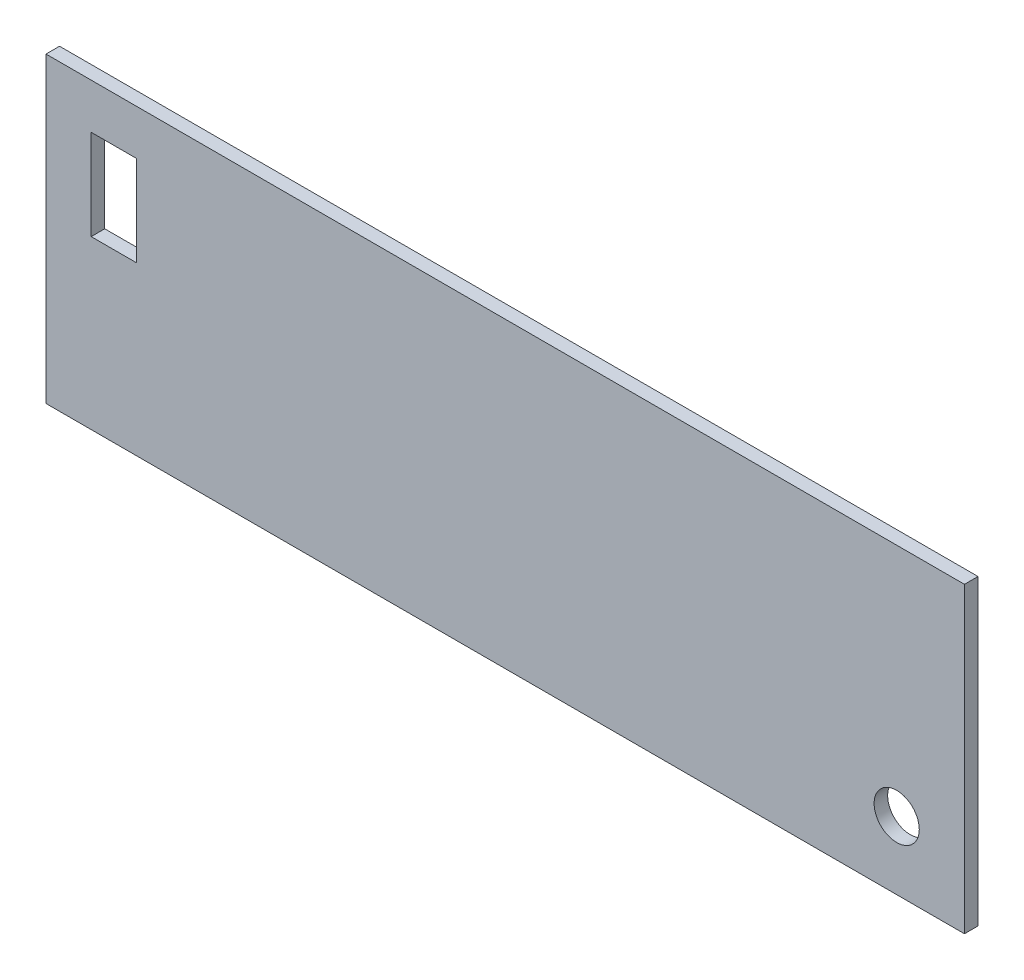
ISO-10303-21;
HEADER;
FILE_DESCRIPTION(('STEP AP214'),'2;1');
FILE_NAME('part.step','',(''),(''),'','','');
FILE_SCHEMA(('AUTOMOTIVE_DESIGN { 1 0 10303 214 1 1 1 1 }'));
ENDSEC;
DATA;
#1=APPLICATION_CONTEXT('core data for automotive mechanical design processes');
#2=APPLICATION_PROTOCOL_DEFINITION('international standard','automotive_design',2000,#1);
#3=PRODUCT_CONTEXT('',#1,'mechanical');
#4=PRODUCT('Part','Part','',(#3));
#5=PRODUCT_RELATED_PRODUCT_CATEGORY('part','',(#4));
#6=PRODUCT_DEFINITION_FORMATION('','',#4);
#7=PRODUCT_DEFINITION_CONTEXT('part definition',#1,'design');
#8=PRODUCT_DEFINITION('design','',#6,#7);
#9=PRODUCT_DEFINITION_SHAPE('','',#8);
#10=(LENGTH_UNIT() NAMED_UNIT(*) SI_UNIT(.MILLI.,.METRE.));
#11=(NAMED_UNIT(*) PLANE_ANGLE_UNIT() SI_UNIT($,.RADIAN.));
#12=(NAMED_UNIT(*) SI_UNIT($,.STERADIAN.) SOLID_ANGLE_UNIT());
#13=UNCERTAINTY_MEASURE_WITH_UNIT(LENGTH_MEASURE(1.E-05),#10,'distance_accuracy_value','');
#14=(GEOMETRIC_REPRESENTATION_CONTEXT(3) GLOBAL_UNCERTAINTY_ASSIGNED_CONTEXT((#13)) GLOBAL_UNIT_ASSIGNED_CONTEXT((#10,
#11,#12)) REPRESENTATION_CONTEXT('',''));
#15=CARTESIAN_POINT('',(0.,0.,0.));
#16=DIRECTION('',(0.,0.,1.));
#17=DIRECTION('',(1.,0.,0.));
#18=AXIS2_PLACEMENT_3D('',#15,#16,#17);
#19=CARTESIAN_POINT('',(101.655,-33.5,-3.));
#20=DIRECTION('',(1.,0.,0.));
#21=DIRECTION('',(0.,0.,-1.));
#22=AXIS2_PLACEMENT_3D('',#19,#20,#21);
#23=PLANE('',#22);
#24=DIRECTION('',(0.,1.,0.));
#25=VECTOR('',#24,1.);
#26=CARTESIAN_POINT('',(101.655,-33.5,0.));
#27=LINE('',#26,#25);
#28=CARTESIAN_POINT('',(101.655,-33.5,0.));
#29=VERTEX_POINT('',#28);
#30=CARTESIAN_POINT('',(101.655,33.5,0.));
#31=VERTEX_POINT('',#30);
#32=EDGE_CURVE('E116',#29,#31,#27,.T.);
#33=ORIENTED_EDGE('',*,*,#32,.F.);
#34=DIRECTION('',(0.,0.,1.));
#35=VECTOR('',#34,1.);
#36=CARTESIAN_POINT('',(101.655,-33.5,-3.));
#37=LINE('',#36,#35);
#38=CARTESIAN_POINT('',(101.655,-33.5,-3.));
#39=VERTEX_POINT('',#38);
#40=EDGE_CURVE('E11',#39,#29,#37,.T.);
#41=ORIENTED_EDGE('',*,*,#40,.F.);
#42=DIRECTION('',(0.,1.,0.));
#43=VECTOR('',#42,1.);
#44=CARTESIAN_POINT('',(101.655,-33.5,-3.));
#45=LINE('',#44,#43);
#46=CARTESIAN_POINT('',(101.655,33.5,-3.));
#47=VERTEX_POINT('',#46);
#48=EDGE_CURVE('E157',#39,#47,#45,.T.);
#49=ORIENTED_EDGE('',*,*,#48,.T.);
#50=DIRECTION('',(0.,0.,1.));
#51=VECTOR('',#50,1.);
#52=CARTESIAN_POINT('',(101.655,33.5,-3.));
#53=LINE('',#52,#51);
#54=EDGE_CURVE('E46',#47,#31,#53,.T.);
#55=ORIENTED_EDGE('',*,*,#54,.T.);
#56=EDGE_LOOP('',(#33,#41,#49,#55));
#57=FACE_BOUND('',#56,.T.);
#58=ADVANCED_FACE('F43',(#57),#23,.T.);
#59=CARTESIAN_POINT('',(-101.655,-33.5,-3.));
#60=DIRECTION('',(0.,-1.,0.));
#61=DIRECTION('',(0.,0.,-1.));
#62=AXIS2_PLACEMENT_3D('',#59,#60,#61);
#63=PLANE('',#62);
#64=DIRECTION('',(1.,0.,0.));
#65=VECTOR('',#64,1.);
#66=CARTESIAN_POINT('',(-101.655,-33.5,0.));
#67=LINE('',#66,#65);
#68=CARTESIAN_POINT('',(-101.655,-33.5,0.));
#69=VERTEX_POINT('',#68);
#70=EDGE_CURVE('E162',#69,#29,#67,.T.);
#71=ORIENTED_EDGE('',*,*,#70,.F.);
#72=DIRECTION('',(0.,0.,1.));
#73=VECTOR('',#72,1.);
#74=CARTESIAN_POINT('',(-101.655,-33.5,-3.));
#75=LINE('',#74,#73);
#76=CARTESIAN_POINT('',(-101.655,-33.5,-3.));
#77=VERTEX_POINT('',#76);
#78=EDGE_CURVE('E52',#77,#69,#75,.T.);
#79=ORIENTED_EDGE('',*,*,#78,.F.);
#80=DIRECTION('',(1.,0.,0.));
#81=VECTOR('',#80,1.);
#82=CARTESIAN_POINT('',(-101.655,-33.5,-3.));
#83=LINE('',#82,#81);
#84=EDGE_CURVE('E170',#77,#39,#83,.T.);
#85=ORIENTED_EDGE('',*,*,#84,.T.);
#86=ORIENTED_EDGE('',*,*,#40,.T.);
#87=EDGE_LOOP('',(#71,#79,#85,#86));
#88=FACE_BOUND('',#87,.T.);
#89=ADVANCED_FACE('F208',(#88),#63,.T.);
#90=CARTESIAN_POINT('',(-101.655,-33.5,-3.));
#91=DIRECTION('',(-1.,0.,0.));
#92=DIRECTION('',(0.,0.,1.));
#93=AXIS2_PLACEMENT_3D('',#90,#91,#92);
#94=PLANE('',#93);
#95=DIRECTION('',(0.,-1.,0.));
#96=VECTOR('',#95,1.);
#97=CARTESIAN_POINT('',(-101.655,-33.5,0.));
#98=LINE('',#97,#96);
#99=CARTESIAN_POINT('',(-101.655,33.5,0.));
#100=VERTEX_POINT('',#99);
#101=EDGE_CURVE('E181',#100,#69,#98,.T.);
#102=ORIENTED_EDGE('',*,*,#101,.F.);
#103=DIRECTION('',(0.,0.,1.));
#104=VECTOR('',#103,1.);
#105=CARTESIAN_POINT('',(-101.655,33.5,-3.));
#106=LINE('',#105,#104);
#107=CARTESIAN_POINT('',(-101.655,33.5,-3.));
#108=VERTEX_POINT('',#107);
#109=EDGE_CURVE('E189',#108,#100,#106,.T.);
#110=ORIENTED_EDGE('',*,*,#109,.F.);
#111=DIRECTION('',(0.,-1.,0.));
#112=VECTOR('',#111,1.);
#113=CARTESIAN_POINT('',(-101.655,-33.5,-3.));
#114=LINE('',#113,#112);
#115=EDGE_CURVE('E166',#108,#77,#114,.T.);
#116=ORIENTED_EDGE('',*,*,#115,.T.);
#117=ORIENTED_EDGE('',*,*,#78,.T.);
#118=EDGE_LOOP('',(#102,#110,#116,#117));
#119=FACE_BOUND('',#118,.T.);
#120=ADVANCED_FACE('F212',(#119),#94,.T.);
#121=CARTESIAN_POINT('',(-101.655,33.5,-3.));
#122=DIRECTION('',(0.,1.,0.));
#123=DIRECTION('',(0.,0.,1.));
#124=AXIS2_PLACEMENT_3D('',#121,#122,#123);
#125=PLANE('',#124);
#126=DIRECTION('',(-1.,0.,0.));
#127=VECTOR('',#126,1.);
#128=CARTESIAN_POINT('',(-101.655,33.5,0.));
#129=LINE('',#128,#127);
#130=EDGE_CURVE('E177',#31,#100,#129,.T.);
#131=ORIENTED_EDGE('',*,*,#130,.F.);
#132=ORIENTED_EDGE('',*,*,#54,.F.);
#133=DIRECTION('',(-1.,0.,0.));
#134=VECTOR('',#133,1.);
#135=CARTESIAN_POINT('',(-101.655,33.5,-3.));
#136=LINE('',#135,#134);
#137=EDGE_CURVE('E161',#47,#108,#136,.T.);
#138=ORIENTED_EDGE('',*,*,#137,.T.);
#139=ORIENTED_EDGE('',*,*,#109,.T.);
#140=EDGE_LOOP('',(#131,#132,#138,#139));
#141=FACE_BOUND('',#140,.T.);
#142=ADVANCED_FACE('F203',(#141),#125,.T.);
#143=CARTESIAN_POINT('',(0.,0.,-3.));
#144=DIRECTION('',(0.,0.,-1.));
#145=DIRECTION('',(-1.,0.,0.));
#146=AXIS2_PLACEMENT_3D('',#143,#144,#145);
#147=PLANE('',#146);
#148=CARTESIAN_POINT('',(86.655,-18.5,-3.));
#149=DIRECTION('',(0.,0.,-1.));
#150=DIRECTION('',(-1.,0.,0.));
#151=AXIS2_PLACEMENT_3D('',#148,#149,#150);
#152=CIRCLE('',#151,5.);
#153=CARTESIAN_POINT('',(81.6549999999999,-18.5,-3.));
#154=VERTEX_POINT('',#153);
#155=EDGE_CURVE('E332',#154,#154,#152,.F.);
#156=ORIENTED_EDGE('',*,*,#155,.T.);
#157=EDGE_LOOP('',(#156));
#158=FACE_BOUND('',#157,.T.);
#159=DIRECTION('',(0.,1.,0.));
#160=VECTOR('',#159,1.);
#161=CARTESIAN_POINT('',(-81.655,3.5,-3.));
#162=LINE('',#161,#160);
#163=CARTESIAN_POINT('',(-81.655,3.5,-3.));
#164=VERTEX_POINT('',#163);
#165=CARTESIAN_POINT('',(-81.655,23.5,-3.));
#166=VERTEX_POINT('',#165);
#167=EDGE_CURVE('E120',#164,#166,#162,.T.);
#168=ORIENTED_EDGE('',*,*,#167,.T.);
#169=DIRECTION('',(-1.,0.,0.));
#170=VECTOR('',#169,1.);
#171=CARTESIAN_POINT('',(-91.655,23.5,-3.));
#172=LINE('',#171,#170);
#173=CARTESIAN_POINT('',(-91.655,23.5,-3.));
#174=VERTEX_POINT('',#173);
#175=EDGE_CURVE('E108',#166,#174,#172,.T.);
#176=ORIENTED_EDGE('',*,*,#175,.T.);
#177=DIRECTION('',(0.,-1.,0.));
#178=VECTOR('',#177,1.);
#179=CARTESIAN_POINT('',(-91.655,3.5,-3.));
#180=LINE('',#179,#178);
#181=CARTESIAN_POINT('',(-91.655,3.5,-3.));
#182=VERTEX_POINT('',#181);
#183=EDGE_CURVE('E137',#174,#182,#180,.T.);
#184=ORIENTED_EDGE('',*,*,#183,.T.);
#185=DIRECTION('',(1.,0.,0.));
#186=VECTOR('',#185,1.);
#187=CARTESIAN_POINT('',(-91.655,3.5,-3.));
#188=LINE('',#187,#186);
#189=EDGE_CURVE('E128',#182,#164,#188,.T.);
#190=ORIENTED_EDGE('',*,*,#189,.T.);
#191=EDGE_LOOP('',(#168,#176,#184,#190));
#192=FACE_BOUND('',#191,.T.);
#193=ORIENTED_EDGE('',*,*,#48,.F.);
#194=ORIENTED_EDGE('',*,*,#84,.F.);
#195=ORIENTED_EDGE('',*,*,#115,.F.);
#196=ORIENTED_EDGE('',*,*,#137,.F.);
#197=EDGE_LOOP('',(#193,#194,#195,#196));
#198=FACE_BOUND('',#197,.T.);
#199=ADVANCED_FACE('F126',(#158,#192,#198),#147,.T.);
#200=CARTESIAN_POINT('',(0.,0.,0.));
#201=DIRECTION('',(0.,0.,-1.));
#202=DIRECTION('',(-1.,0.,0.));
#203=AXIS2_PLACEMENT_3D('',#200,#201,#202);
#204=PLANE('',#203);
#205=CARTESIAN_POINT('',(86.655,-18.5,0.));
#206=DIRECTION('',(0.,0.,1.));
#207=DIRECTION('',(1.,0.,0.));
#208=AXIS2_PLACEMENT_3D('',#205,#206,#207);
#209=CIRCLE('',#208,5.);
#210=CARTESIAN_POINT('',(91.655,-18.5,0.));
#211=VERTEX_POINT('',#210);
#212=EDGE_CURVE('E335',#211,#211,#209,.T.);
#213=ORIENTED_EDGE('',*,*,#212,.F.);
#214=EDGE_LOOP('',(#213));
#215=FACE_BOUND('',#214,.T.);
#216=DIRECTION('',(-1.,0.,0.));
#217=VECTOR('',#216,1.);
#218=CARTESIAN_POINT('',(-91.655,23.5,0.));
#219=LINE('',#218,#217);
#220=CARTESIAN_POINT('',(-81.655,23.5,0.));
#221=VERTEX_POINT('',#220);
#222=CARTESIAN_POINT('',(-91.655,23.5,0.));
#223=VERTEX_POINT('',#222);
#224=EDGE_CURVE('E135',#221,#223,#219,.T.);
#225=ORIENTED_EDGE('',*,*,#224,.F.);
#226=DIRECTION('',(0.,1.,0.));
#227=VECTOR('',#226,1.);
#228=CARTESIAN_POINT('',(-81.655,3.5,0.));
#229=LINE('',#228,#227);
#230=CARTESIAN_POINT('',(-81.655,3.5,0.));
#231=VERTEX_POINT('',#230);
#232=EDGE_CURVE('E68',#231,#221,#229,.T.);
#233=ORIENTED_EDGE('',*,*,#232,.F.);
#234=DIRECTION('',(1.,0.,0.));
#235=VECTOR('',#234,1.);
#236=CARTESIAN_POINT('',(-91.655,3.5,0.));
#237=LINE('',#236,#235);
#238=CARTESIAN_POINT('',(-91.655,3.5,0.));
#239=VERTEX_POINT('',#238);
#240=EDGE_CURVE('E123',#239,#231,#237,.T.);
#241=ORIENTED_EDGE('',*,*,#240,.F.);
#242=DIRECTION('',(0.,-1.,0.));
#243=VECTOR('',#242,1.);
#244=CARTESIAN_POINT('',(-91.655,3.5,0.));
#245=LINE('',#244,#243);
#246=EDGE_CURVE('E143',#223,#239,#245,.T.);
#247=ORIENTED_EDGE('',*,*,#246,.F.);
#248=EDGE_LOOP('',(#225,#233,#241,#247));
#249=FACE_BOUND('',#248,.T.);
#250=ORIENTED_EDGE('',*,*,#32,.T.);
#251=ORIENTED_EDGE('',*,*,#130,.T.);
#252=ORIENTED_EDGE('',*,*,#101,.T.);
#253=ORIENTED_EDGE('',*,*,#70,.T.);
#254=EDGE_LOOP('',(#250,#251,#252,#253));
#255=FACE_BOUND('',#254,.T.);
#256=ADVANCED_FACE('F205',(#215,#249,#255),#204,.F.);
#257=CARTESIAN_POINT('',(-81.655,3.5,-3.001));
#258=DIRECTION('',(1.,0.,0.));
#259=DIRECTION('',(0.,0.,-1.));
#260=AXIS2_PLACEMENT_3D('',#257,#258,#259);
#261=PLANE('',#260);
#262=DIRECTION('',(0.,0.,1.));
#263=VECTOR('',#262,1.);
#264=CARTESIAN_POINT('',(-81.655,3.5,-3.001));
#265=LINE('',#264,#263);
#266=EDGE_CURVE('E117',#164,#231,#265,.T.);
#267=ORIENTED_EDGE('',*,*,#266,.T.);
#268=ORIENTED_EDGE('',*,*,#232,.T.);
#269=DIRECTION('',(0.,0.,1.));
#270=VECTOR('',#269,1.);
#271=CARTESIAN_POINT('',(-81.655,23.5,-3.001));
#272=LINE('',#271,#270);
#273=EDGE_CURVE('E110',#166,#221,#272,.T.);
#274=ORIENTED_EDGE('',*,*,#273,.F.);
#275=ORIENTED_EDGE('',*,*,#167,.F.);
#276=EDGE_LOOP('',(#267,#268,#274,#275));
#277=FACE_BOUND('',#276,.T.);
#278=ADVANCED_FACE('F119',(#277),#261,.F.);
#279=CARTESIAN_POINT('',(-91.655,3.5,-3.001));
#280=DIRECTION('',(0.,-1.,0.));
#281=DIRECTION('',(0.,0.,-1.));
#282=AXIS2_PLACEMENT_3D('',#279,#280,#281);
#283=PLANE('',#282);
#284=DIRECTION('',(0.,0.,1.));
#285=VECTOR('',#284,1.);
#286=CARTESIAN_POINT('',(-91.655,3.5,-3.001));
#287=LINE('',#286,#285);
#288=EDGE_CURVE('E152',#182,#239,#287,.T.);
#289=ORIENTED_EDGE('',*,*,#288,.T.);
#290=ORIENTED_EDGE('',*,*,#240,.T.);
#291=ORIENTED_EDGE('',*,*,#266,.F.);
#292=ORIENTED_EDGE('',*,*,#189,.F.);
#293=EDGE_LOOP('',(#289,#290,#291,#292));
#294=FACE_BOUND('',#293,.T.);
#295=ADVANCED_FACE('F266',(#294),#283,.F.);
#296=CARTESIAN_POINT('',(-91.655,3.5,-3.001));
#297=DIRECTION('',(-1.,0.,0.));
#298=DIRECTION('',(0.,0.,1.));
#299=AXIS2_PLACEMENT_3D('',#296,#297,#298);
#300=PLANE('',#299);
#301=DIRECTION('',(0.,0.,1.));
#302=VECTOR('',#301,1.);
#303=CARTESIAN_POINT('',(-91.655,23.5,-3.001));
#304=LINE('',#303,#302);
#305=EDGE_CURVE('E60',#174,#223,#304,.T.);
#306=ORIENTED_EDGE('',*,*,#305,.T.);
#307=ORIENTED_EDGE('',*,*,#246,.T.);
#308=ORIENTED_EDGE('',*,*,#288,.F.);
#309=ORIENTED_EDGE('',*,*,#183,.F.);
#310=EDGE_LOOP('',(#306,#307,#308,#309));
#311=FACE_BOUND('',#310,.T.);
#312=ADVANCED_FACE('F275',(#311),#300,.F.);
#313=CARTESIAN_POINT('',(-91.655,23.5,-3.001));
#314=DIRECTION('',(0.,1.,0.));
#315=DIRECTION('',(0.,0.,1.));
#316=AXIS2_PLACEMENT_3D('',#313,#314,#315);
#317=PLANE('',#316);
#318=ORIENTED_EDGE('',*,*,#273,.T.);
#319=ORIENTED_EDGE('',*,*,#224,.T.);
#320=ORIENTED_EDGE('',*,*,#305,.F.);
#321=ORIENTED_EDGE('',*,*,#175,.F.);
#322=EDGE_LOOP('',(#318,#319,#320,#321));
#323=FACE_BOUND('',#322,.T.);
#324=ADVANCED_FACE('F109',(#323),#317,.F.);
#325=CARTESIAN_POINT('',(86.655,-18.5,-3.001));
#326=DIRECTION('',(0.,0.,1.));
#327=DIRECTION('',(1.,0.,0.));
#328=AXIS2_PLACEMENT_3D('',#325,#326,#327);
#329=CYLINDRICAL_SURFACE('',#328,5.);
#330=ORIENTED_EDGE('',*,*,#155,.F.);
#331=EDGE_LOOP('',(#330));
#332=FACE_BOUND('',#331,.T.);
#333=ORIENTED_EDGE('',*,*,#212,.T.);
#334=EDGE_LOOP('',(#333));
#335=FACE_BOUND('',#334,.T.);
#336=ADVANCED_FACE('F293',(#332,#335),#329,.F.);
#337=CLOSED_SHELL('',(#58,#89,#120,#142,#199,#256,#278,#295,#312,#324,#336));
#338=MANIFOLD_SOLID_BREP('B2',#337);
#339=ADVANCED_BREP_SHAPE_REPRESENTATION('',(#18,#338),#14);
#340=SHAPE_DEFINITION_REPRESENTATION(#9,#339);
ENDSEC;
END-ISO-10303-21;
